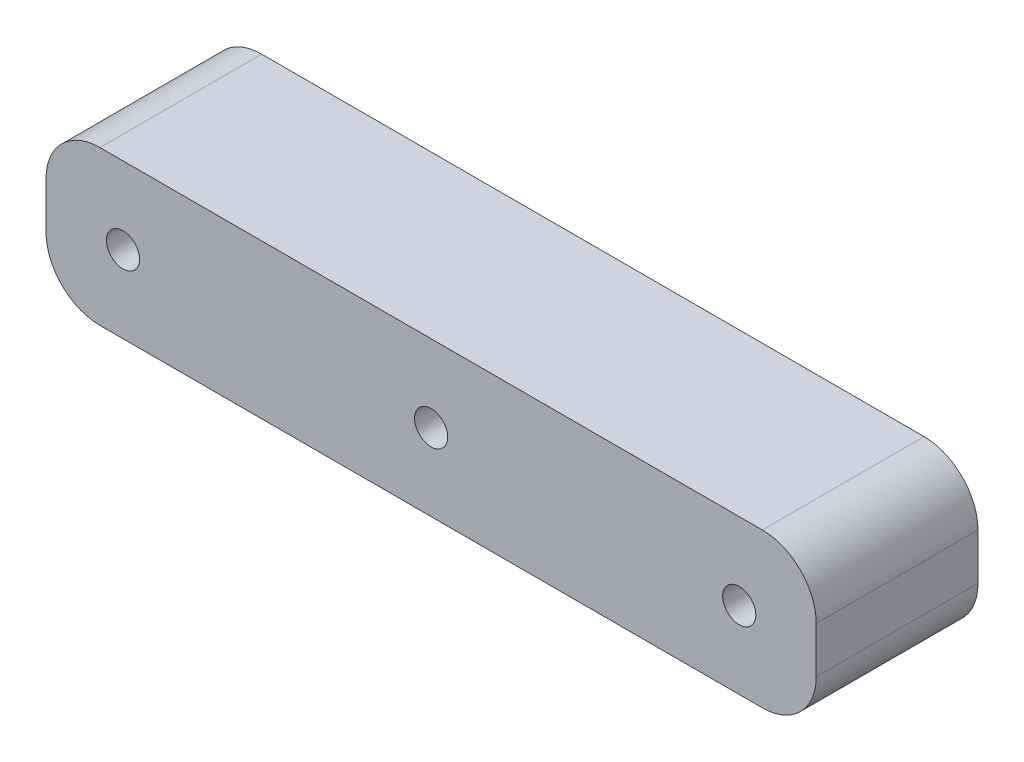
ISO-10303-21;
HEADER;
FILE_DESCRIPTION(('STEP AP214'),'2;1');
FILE_NAME('part.step','',(''),(''),'','','');
FILE_SCHEMA(('AUTOMOTIVE_DESIGN { 1 0 10303 214 1 1 1 1 }'));
ENDSEC;
DATA;
#1=APPLICATION_CONTEXT('core data for automotive mechanical design processes');
#2=APPLICATION_PROTOCOL_DEFINITION('international standard','automotive_design',2000,#1);
#3=PRODUCT_CONTEXT('',#1,'mechanical');
#4=PRODUCT('Part','Part','',(#3));
#5=PRODUCT_RELATED_PRODUCT_CATEGORY('part','',(#4));
#6=PRODUCT_DEFINITION_FORMATION('','',#4);
#7=PRODUCT_DEFINITION_CONTEXT('part definition',#1,'design');
#8=PRODUCT_DEFINITION('design','',#6,#7);
#9=PRODUCT_DEFINITION_SHAPE('','',#8);
#10=(LENGTH_UNIT() NAMED_UNIT(*) SI_UNIT(.MILLI.,.METRE.));
#11=(NAMED_UNIT(*) PLANE_ANGLE_UNIT() SI_UNIT($,.RADIAN.));
#12=(NAMED_UNIT(*) SI_UNIT($,.STERADIAN.) SOLID_ANGLE_UNIT());
#13=UNCERTAINTY_MEASURE_WITH_UNIT(LENGTH_MEASURE(1.E-05),#10,'distance_accuracy_value','');
#14=(GEOMETRIC_REPRESENTATION_CONTEXT(3) GLOBAL_UNCERTAINTY_ASSIGNED_CONTEXT((#13)) GLOBAL_UNIT_ASSIGNED_CONTEXT((#10,
#11,#12)) REPRESENTATION_CONTEXT('',''));
#15=CARTESIAN_POINT('',(0.,0.,0.));
#16=DIRECTION('',(0.,0.,1.));
#17=DIRECTION('',(1.,0.,0.));
#18=AXIS2_PLACEMENT_3D('',#15,#16,#17);
#19=CARTESIAN_POINT('',(0.,0.,21.));
#20=DIRECTION('',(0.,0.,1.));
#21=DIRECTION('',(1.,0.,0.));
#22=AXIS2_PLACEMENT_3D('',#19,#20,#21);
#23=PLANE('',#22);
#24=CARTESIAN_POINT('',(90.,-10.,21.));
#25=DIRECTION('',(0.,0.,1.));
#26=DIRECTION('',(-1.,0.,0.));
#27=AXIS2_PLACEMENT_3D('',#24,#25,#26);
#28=CIRCLE('',#27,2.15);
#29=CARTESIAN_POINT('',(87.85,-10.,21.));
#30=VERTEX_POINT('',#29);
#31=EDGE_CURVE('E178',#30,#30,#28,.T.);
#32=ORIENTED_EDGE('',*,*,#31,.F.);
#33=EDGE_LOOP('',(#32));
#34=FACE_BOUND('',#33,.T.);
#35=DIRECTION('',(0.,1.,0.));
#36=VECTOR('',#35,1.);
#37=CARTESIAN_POINT('',(100.,0.,21.));
#38=LINE('',#37,#36);
#39=CARTESIAN_POINT('',(100.,-13.,21.));
#40=VERTEX_POINT('',#39);
#41=CARTESIAN_POINT('',(100.,-7.,21.));
#42=VERTEX_POINT('',#41);
#43=EDGE_CURVE('E173',#40,#42,#38,.T.);
#44=ORIENTED_EDGE('',*,*,#43,.T.);
#45=CARTESIAN_POINT('',(93.,-7.,21.));
#46=DIRECTION('',(0.,0.,1.));
#47=DIRECTION('',(1.,0.,0.));
#48=AXIS2_PLACEMENT_3D('',#45,#46,#47);
#49=CIRCLE('',#48,7.);
#50=CARTESIAN_POINT('',(93.,0.,21.));
#51=VERTEX_POINT('',#50);
#52=EDGE_CURVE('E150',#42,#51,#49,.T.);
#53=ORIENTED_EDGE('',*,*,#52,.T.);
#54=DIRECTION('',(-1.,0.,0.));
#55=VECTOR('',#54,1.);
#56=CARTESIAN_POINT('',(0.,0.,21.));
#57=LINE('',#56,#55);
#58=CARTESIAN_POINT('',(7.,0.,21.));
#59=VERTEX_POINT('',#58);
#60=EDGE_CURVE('E121',#51,#59,#57,.T.);
#61=ORIENTED_EDGE('',*,*,#60,.T.);
#62=CARTESIAN_POINT('',(7.,-7.,21.));
#63=DIRECTION('',(0.,0.,1.));
#64=DIRECTION('',(1.,0.,0.));
#65=AXIS2_PLACEMENT_3D('',#62,#63,#64);
#66=CIRCLE('',#65,7.);
#67=CARTESIAN_POINT('',(0.,-7.,21.));
#68=VERTEX_POINT('',#67);
#69=EDGE_CURVE('E145',#59,#68,#66,.T.);
#70=ORIENTED_EDGE('',*,*,#69,.T.);
#71=DIRECTION('',(0.,-1.,0.));
#72=VECTOR('',#71,1.);
#73=CARTESIAN_POINT('',(0.,0.,21.));
#74=LINE('',#73,#72);
#75=CARTESIAN_POINT('',(0.,-13.,21.));
#76=VERTEX_POINT('',#75);
#77=EDGE_CURVE('E128',#68,#76,#74,.T.);
#78=ORIENTED_EDGE('',*,*,#77,.T.);
#79=CARTESIAN_POINT('',(7.,-13.,21.));
#80=DIRECTION('',(0.,0.,1.));
#81=DIRECTION('',(1.,0.,0.));
#82=AXIS2_PLACEMENT_3D('',#79,#80,#81);
#83=CIRCLE('',#82,7.);
#84=CARTESIAN_POINT('',(7.,-20.,21.));
#85=VERTEX_POINT('',#84);
#86=EDGE_CURVE('E57',#76,#85,#83,.T.);
#87=ORIENTED_EDGE('',*,*,#86,.T.);
#88=DIRECTION('',(1.,0.,0.));
#89=VECTOR('',#88,1.);
#90=CARTESIAN_POINT('',(0.,-20.,21.));
#91=LINE('',#90,#89);
#92=CARTESIAN_POINT('',(93.,-20.,21.));
#93=VERTEX_POINT('',#92);
#94=EDGE_CURVE('E131',#85,#93,#91,.T.);
#95=ORIENTED_EDGE('',*,*,#94,.T.);
#96=CARTESIAN_POINT('',(93.,-13.,21.));
#97=DIRECTION('',(0.,0.,1.));
#98=DIRECTION('',(1.,0.,0.));
#99=AXIS2_PLACEMENT_3D('',#96,#97,#98);
#100=CIRCLE('',#99,7.);
#101=EDGE_CURVE('E148',#93,#40,#100,.T.);
#102=ORIENTED_EDGE('',*,*,#101,.T.);
#103=EDGE_LOOP('',(#44,#53,#61,#70,#78,#87,#95,#102));
#104=FACE_BOUND('',#103,.T.);
#105=CARTESIAN_POINT('',(10.,-10.,21.));
#106=DIRECTION('',(0.,0.,1.));
#107=DIRECTION('',(1.,0.,0.));
#108=AXIS2_PLACEMENT_3D('',#105,#106,#107);
#109=CIRCLE('',#108,2.15);
#110=CARTESIAN_POINT('',(12.15,-10.,21.));
#111=VERTEX_POINT('',#110);
#112=EDGE_CURVE('E166',#111,#111,#109,.T.);
#113=ORIENTED_EDGE('',*,*,#112,.F.);
#114=EDGE_LOOP('',(#113));
#115=FACE_BOUND('',#114,.T.);
#116=CARTESIAN_POINT('',(50.,-9.99999999999545,21.));
#117=DIRECTION('',(0.,0.,1.));
#118=DIRECTION('',(1.,0.,0.));
#119=AXIS2_PLACEMENT_3D('',#116,#117,#118);
#120=CIRCLE('',#119,2.15);
#121=CARTESIAN_POINT('',(52.15,-9.99999999999545,21.));
#122=VERTEX_POINT('',#121);
#123=EDGE_CURVE('E183',#122,#122,#120,.T.);
#124=ORIENTED_EDGE('',*,*,#123,.F.);
#125=EDGE_LOOP('',(#124));
#126=FACE_BOUND('',#125,.T.);
#127=ADVANCED_FACE('F35',(#34,#104,#115,#126),#23,.T.);
#128=CARTESIAN_POINT('',(0.,0.,0.));
#129=DIRECTION('',(0.,0.,1.));
#130=DIRECTION('',(1.,0.,0.));
#131=AXIS2_PLACEMENT_3D('',#128,#129,#130);
#132=PLANE('',#131);
#133=DIRECTION('',(-1.,0.,0.));
#134=VECTOR('',#133,1.);
#135=CARTESIAN_POINT('',(0.,0.,0.));
#136=LINE('',#135,#134);
#137=CARTESIAN_POINT('',(93.,0.,0.));
#138=VERTEX_POINT('',#137);
#139=CARTESIAN_POINT('',(7.,0.,0.));
#140=VERTEX_POINT('',#139);
#141=EDGE_CURVE('E118',#138,#140,#136,.T.);
#142=ORIENTED_EDGE('',*,*,#141,.F.);
#143=CARTESIAN_POINT('',(93.,-7.,0.));
#144=DIRECTION('',(0.,0.,1.));
#145=DIRECTION('',(1.,0.,0.));
#146=AXIS2_PLACEMENT_3D('',#143,#144,#145);
#147=CIRCLE('',#146,7.);
#148=CARTESIAN_POINT('',(100.,-7.,0.));
#149=VERTEX_POINT('',#148);
#150=EDGE_CURVE('E101',#138,#149,#147,.F.);
#151=ORIENTED_EDGE('',*,*,#150,.T.);
#152=DIRECTION('',(0.,1.,0.));
#153=VECTOR('',#152,1.);
#154=CARTESIAN_POINT('',(100.,0.,0.));
#155=LINE('',#154,#153);
#156=CARTESIAN_POINT('',(100.,-13.,0.));
#157=VERTEX_POINT('',#156);
#158=EDGE_CURVE('E129',#157,#149,#155,.T.);
#159=ORIENTED_EDGE('',*,*,#158,.F.);
#160=CARTESIAN_POINT('',(93.,-13.,0.));
#161=DIRECTION('',(0.,0.,1.));
#162=DIRECTION('',(1.,0.,0.));
#163=AXIS2_PLACEMENT_3D('',#160,#161,#162);
#164=CIRCLE('',#163,7.);
#165=CARTESIAN_POINT('',(93.,-20.,0.));
#166=VERTEX_POINT('',#165);
#167=EDGE_CURVE('E112',#157,#166,#164,.F.);
#168=ORIENTED_EDGE('',*,*,#167,.T.);
#169=DIRECTION('',(1.,0.,0.));
#170=VECTOR('',#169,1.);
#171=CARTESIAN_POINT('',(0.,-20.,0.));
#172=LINE('',#171,#170);
#173=CARTESIAN_POINT('',(7.,-20.,0.));
#174=VERTEX_POINT('',#173);
#175=EDGE_CURVE('E133',#174,#166,#172,.T.);
#176=ORIENTED_EDGE('',*,*,#175,.F.);
#177=CARTESIAN_POINT('',(7.,-13.,0.));
#178=DIRECTION('',(0.,0.,1.));
#179=DIRECTION('',(1.,0.,0.));
#180=AXIS2_PLACEMENT_3D('',#177,#178,#179);
#181=CIRCLE('',#180,7.);
#182=CARTESIAN_POINT('',(0.,-13.,0.));
#183=VERTEX_POINT('',#182);
#184=EDGE_CURVE('E139',#174,#183,#181,.F.);
#185=ORIENTED_EDGE('',*,*,#184,.T.);
#186=DIRECTION('',(0.,-1.,0.));
#187=VECTOR('',#186,1.);
#188=CARTESIAN_POINT('',(0.,0.,0.));
#189=LINE('',#188,#187);
#190=CARTESIAN_POINT('',(0.,-7.,0.));
#191=VERTEX_POINT('',#190);
#192=EDGE_CURVE('E161',#191,#183,#189,.T.);
#193=ORIENTED_EDGE('',*,*,#192,.F.);
#194=CARTESIAN_POINT('',(7.,-7.,0.));
#195=DIRECTION('',(0.,0.,1.));
#196=DIRECTION('',(1.,0.,0.));
#197=AXIS2_PLACEMENT_3D('',#194,#195,#196);
#198=CIRCLE('',#197,7.);
#199=EDGE_CURVE('E122',#191,#140,#198,.F.);
#200=ORIENTED_EDGE('',*,*,#199,.T.);
#201=EDGE_LOOP('',(#142,#151,#159,#168,#176,#185,#193,#200));
#202=FACE_BOUND('',#201,.T.);
#203=CARTESIAN_POINT('',(10.,-10.,0.));
#204=DIRECTION('',(0.,0.,1.));
#205=DIRECTION('',(1.,0.,0.));
#206=AXIS2_PLACEMENT_3D('',#203,#204,#205);
#207=CIRCLE('',#206,2.15);
#208=CARTESIAN_POINT('',(12.15,-10.,0.));
#209=VERTEX_POINT('',#208);
#210=EDGE_CURVE('E169',#209,#209,#207,.T.);
#211=ORIENTED_EDGE('',*,*,#210,.T.);
#212=EDGE_LOOP('',(#211));
#213=FACE_BOUND('',#212,.T.);
#214=CARTESIAN_POINT('',(90.,-10.,0.));
#215=DIRECTION('',(0.,0.,1.));
#216=DIRECTION('',(-1.,0.,0.));
#217=AXIS2_PLACEMENT_3D('',#214,#215,#216);
#218=CIRCLE('',#217,2.15);
#219=CARTESIAN_POINT('',(87.85,-10.,0.));
#220=VERTEX_POINT('',#219);
#221=EDGE_CURVE('E180',#220,#220,#218,.T.);
#222=ORIENTED_EDGE('',*,*,#221,.T.);
#223=EDGE_LOOP('',(#222));
#224=FACE_BOUND('',#223,.T.);
#225=CARTESIAN_POINT('',(50.,-9.99999999999545,0.));
#226=DIRECTION('',(0.,0.,1.));
#227=DIRECTION('',(1.,0.,0.));
#228=AXIS2_PLACEMENT_3D('',#225,#226,#227);
#229=CIRCLE('',#228,2.15);
#230=CARTESIAN_POINT('',(52.15,-9.99999999999545,0.));
#231=VERTEX_POINT('',#230);
#232=EDGE_CURVE('E186',#231,#231,#229,.T.);
#233=ORIENTED_EDGE('',*,*,#232,.T.);
#234=EDGE_LOOP('',(#233));
#235=FACE_BOUND('',#234,.T.);
#236=ADVANCED_FACE('F125',(#202,#213,#224,#235),#132,.F.);
#237=CARTESIAN_POINT('',(0.,0.,21.));
#238=DIRECTION('',(1.,0.,0.));
#239=DIRECTION('',(0.,1.,0.));
#240=AXIS2_PLACEMENT_3D('',#237,#238,#239);
#241=PLANE('',#240);
#242=ORIENTED_EDGE('',*,*,#192,.T.);
#243=DIRECTION('',(0.,0.,-1.));
#244=VECTOR('',#243,1.);
#245=CARTESIAN_POINT('',(0.,-13.,21.));
#246=LINE('',#245,#244);
#247=EDGE_CURVE('E11',#183,#76,#246,.F.);
#248=ORIENTED_EDGE('',*,*,#247,.T.);
#249=ORIENTED_EDGE('',*,*,#77,.F.);
#250=DIRECTION('',(0.,0.,-1.));
#251=VECTOR('',#250,1.);
#252=CARTESIAN_POINT('',(0.,-7.,21.));
#253=LINE('',#252,#251);
#254=EDGE_CURVE('E43',#68,#191,#253,.T.);
#255=ORIENTED_EDGE('',*,*,#254,.T.);
#256=EDGE_LOOP('',(#242,#248,#249,#255));
#257=FACE_BOUND('',#256,.T.);
#258=ADVANCED_FACE('F160',(#257),#241,.F.);
#259=CARTESIAN_POINT('',(0.,-20.,21.));
#260=DIRECTION('',(0.,1.,0.));
#261=DIRECTION('',(0.,0.,1.));
#262=AXIS2_PLACEMENT_3D('',#259,#260,#261);
#263=PLANE('',#262);
#264=ORIENTED_EDGE('',*,*,#175,.T.);
#265=DIRECTION('',(0.,0.,-1.));
#266=VECTOR('',#265,1.);
#267=CARTESIAN_POINT('',(93.,-20.,21.));
#268=LINE('',#267,#266);
#269=EDGE_CURVE('E50',#166,#93,#268,.F.);
#270=ORIENTED_EDGE('',*,*,#269,.T.);
#271=ORIENTED_EDGE('',*,*,#94,.F.);
#272=DIRECTION('',(0.,0.,-1.));
#273=VECTOR('',#272,1.);
#274=CARTESIAN_POINT('',(7.,-20.,21.));
#275=LINE('',#274,#273);
#276=EDGE_CURVE('E152',#85,#174,#275,.T.);
#277=ORIENTED_EDGE('',*,*,#276,.T.);
#278=EDGE_LOOP('',(#264,#270,#271,#277));
#279=FACE_BOUND('',#278,.T.);
#280=ADVANCED_FACE('F212',(#279),#263,.F.);
#281=CARTESIAN_POINT('',(100.,0.,21.));
#282=DIRECTION('',(-1.,0.,0.));
#283=DIRECTION('',(0.,0.,1.));
#284=AXIS2_PLACEMENT_3D('',#281,#282,#283);
#285=PLANE('',#284);
#286=ORIENTED_EDGE('',*,*,#158,.T.);
#287=DIRECTION('',(0.,0.,-1.));
#288=VECTOR('',#287,1.);
#289=CARTESIAN_POINT('',(100.,-7.,21.));
#290=LINE('',#289,#288);
#291=EDGE_CURVE('E106',#149,#42,#290,.F.);
#292=ORIENTED_EDGE('',*,*,#291,.T.);
#293=ORIENTED_EDGE('',*,*,#43,.F.);
#294=DIRECTION('',(0.,0.,-1.));
#295=VECTOR('',#294,1.);
#296=CARTESIAN_POINT('',(100.,-13.,21.));
#297=LINE('',#296,#295);
#298=EDGE_CURVE('E111',#40,#157,#297,.T.);
#299=ORIENTED_EDGE('',*,*,#298,.T.);
#300=EDGE_LOOP('',(#286,#292,#293,#299));
#301=FACE_BOUND('',#300,.T.);
#302=ADVANCED_FACE('F209',(#301),#285,.F.);
#303=CARTESIAN_POINT('',(0.,0.,21.));
#304=DIRECTION('',(0.,-1.,0.));
#305=DIRECTION('',(0.,0.,-1.));
#306=AXIS2_PLACEMENT_3D('',#303,#304,#305);
#307=PLANE('',#306);
#308=ORIENTED_EDGE('',*,*,#60,.F.);
#309=DIRECTION('',(0.,0.,-1.));
#310=VECTOR('',#309,1.);
#311=CARTESIAN_POINT('',(93.,0.,21.));
#312=LINE('',#311,#310);
#313=EDGE_CURVE('E105',#51,#138,#312,.T.);
#314=ORIENTED_EDGE('',*,*,#313,.T.);
#315=ORIENTED_EDGE('',*,*,#141,.T.);
#316=DIRECTION('',(0.,0.,-1.));
#317=VECTOR('',#316,1.);
#318=CARTESIAN_POINT('',(7.,0.,21.));
#319=LINE('',#318,#317);
#320=EDGE_CURVE('E123',#140,#59,#319,.F.);
#321=ORIENTED_EDGE('',*,*,#320,.T.);
#322=EDGE_LOOP('',(#308,#314,#315,#321));
#323=FACE_BOUND('',#322,.T.);
#324=ADVANCED_FACE('F117',(#323),#307,.F.);
#325=CARTESIAN_POINT('',(10.,-10.,21.));
#326=DIRECTION('',(0.,0.,-1.));
#327=DIRECTION('',(-1.,0.,0.));
#328=AXIS2_PLACEMENT_3D('',#325,#326,#327);
#329=CYLINDRICAL_SURFACE('',#328,2.15);
#330=ORIENTED_EDGE('',*,*,#112,.T.);
#331=EDGE_LOOP('',(#330));
#332=FACE_BOUND('',#331,.T.);
#333=ORIENTED_EDGE('',*,*,#210,.F.);
#334=EDGE_LOOP('',(#333));
#335=FACE_BOUND('',#334,.T.);
#336=ADVANCED_FACE('F204',(#332,#335),#329,.F.);
#337=CARTESIAN_POINT('',(90.,-10.,21.));
#338=DIRECTION('',(0.,0.,-1.));
#339=DIRECTION('',(-1.,0.,0.));
#340=AXIS2_PLACEMENT_3D('',#337,#338,#339);
#341=CYLINDRICAL_SURFACE('',#340,2.15);
#342=ORIENTED_EDGE('',*,*,#31,.T.);
#343=EDGE_LOOP('',(#342));
#344=FACE_BOUND('',#343,.T.);
#345=ORIENTED_EDGE('',*,*,#221,.F.);
#346=EDGE_LOOP('',(#345));
#347=FACE_BOUND('',#346,.T.);
#348=ADVANCED_FACE('F238',(#344,#347),#341,.F.);
#349=CARTESIAN_POINT('',(50.,-9.99999999999545,21.));
#350=DIRECTION('',(0.,0.,-1.));
#351=DIRECTION('',(-1.,0.,0.));
#352=AXIS2_PLACEMENT_3D('',#349,#350,#351);
#353=CYLINDRICAL_SURFACE('',#352,2.15);
#354=ORIENTED_EDGE('',*,*,#123,.T.);
#355=EDGE_LOOP('',(#354));
#356=FACE_BOUND('',#355,.T.);
#357=ORIENTED_EDGE('',*,*,#232,.F.);
#358=EDGE_LOOP('',(#357));
#359=FACE_BOUND('',#358,.T.);
#360=ADVANCED_FACE('F192',(#356,#359),#353,.F.);
#361=CARTESIAN_POINT('',(93.,-7.,21.));
#362=DIRECTION('',(0.,0.,-1.));
#363=DIRECTION('',(-1.,0.,0.));
#364=AXIS2_PLACEMENT_3D('',#361,#362,#363);
#365=CYLINDRICAL_SURFACE('',#364,7.);
#366=ORIENTED_EDGE('',*,*,#52,.F.);
#367=ORIENTED_EDGE('',*,*,#291,.F.);
#368=ORIENTED_EDGE('',*,*,#150,.F.);
#369=ORIENTED_EDGE('',*,*,#313,.F.);
#370=EDGE_LOOP('',(#366,#367,#368,#369));
#371=FACE_BOUND('',#370,.T.);
#372=ADVANCED_FACE('F104',(#371),#365,.T.);
#373=CARTESIAN_POINT('',(93.,-13.,21.));
#374=DIRECTION('',(0.,0.,-1.));
#375=DIRECTION('',(-1.,0.,0.));
#376=AXIS2_PLACEMENT_3D('',#373,#374,#375);
#377=CYLINDRICAL_SURFACE('',#376,7.);
#378=ORIENTED_EDGE('',*,*,#101,.F.);
#379=ORIENTED_EDGE('',*,*,#269,.F.);
#380=ORIENTED_EDGE('',*,*,#167,.F.);
#381=ORIENTED_EDGE('',*,*,#298,.F.);
#382=EDGE_LOOP('',(#378,#379,#380,#381));
#383=FACE_BOUND('',#382,.T.);
#384=ADVANCED_FACE('F220',(#383),#377,.T.);
#385=CARTESIAN_POINT('',(7.,-13.,21.));
#386=DIRECTION('',(0.,0.,-1.));
#387=DIRECTION('',(-1.,0.,0.));
#388=AXIS2_PLACEMENT_3D('',#385,#386,#387);
#389=CYLINDRICAL_SURFACE('',#388,7.);
#390=ORIENTED_EDGE('',*,*,#86,.F.);
#391=ORIENTED_EDGE('',*,*,#247,.F.);
#392=ORIENTED_EDGE('',*,*,#184,.F.);
#393=ORIENTED_EDGE('',*,*,#276,.F.);
#394=EDGE_LOOP('',(#390,#391,#392,#393));
#395=FACE_BOUND('',#394,.T.);
#396=ADVANCED_FACE('F222',(#395),#389,.T.);
#397=CARTESIAN_POINT('',(7.,-7.,21.));
#398=DIRECTION('',(0.,0.,-1.));
#399=DIRECTION('',(-1.,0.,0.));
#400=AXIS2_PLACEMENT_3D('',#397,#398,#399);
#401=CYLINDRICAL_SURFACE('',#400,7.);
#402=ORIENTED_EDGE('',*,*,#69,.F.);
#403=ORIENTED_EDGE('',*,*,#320,.F.);
#404=ORIENTED_EDGE('',*,*,#199,.F.);
#405=ORIENTED_EDGE('',*,*,#254,.F.);
#406=EDGE_LOOP('',(#402,#403,#404,#405));
#407=FACE_BOUND('',#406,.T.);
#408=ADVANCED_FACE('F37',(#407),#401,.T.);
#409=CLOSED_SHELL('',(#127,#236,#258,#280,#302,#324,#336,#348,#360,#372,#384,#396,#408));
#410=MANIFOLD_SOLID_BREP('B2',#409);
#411=ADVANCED_BREP_SHAPE_REPRESENTATION('',(#18,#410),#14);
#412=SHAPE_DEFINITION_REPRESENTATION(#9,#411);
ENDSEC;
END-ISO-10303-21;
